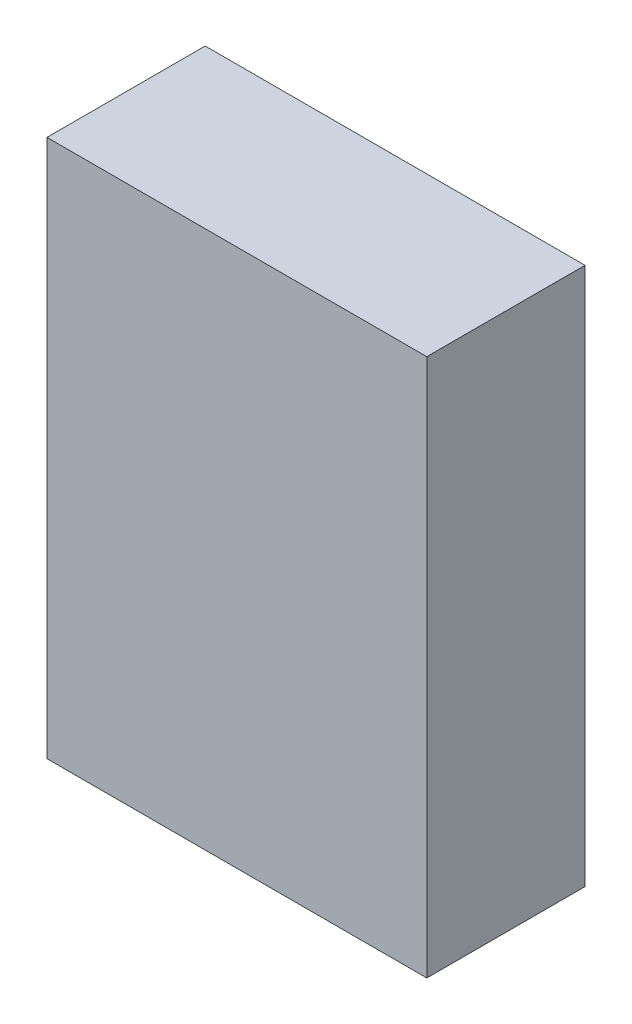
ISO-10303-21;
HEADER;
FILE_DESCRIPTION(('STEP AP214'),'2;1');
FILE_NAME('part.step','',(''),(''),'','','');
FILE_SCHEMA(('AUTOMOTIVE_DESIGN { 1 0 10303 214 1 1 1 1 }'));
ENDSEC;
DATA;
#1=APPLICATION_CONTEXT('core data for automotive mechanical design processes');
#2=APPLICATION_PROTOCOL_DEFINITION('international standard','automotive_design',2000,#1);
#3=PRODUCT_CONTEXT('',#1,'mechanical');
#4=PRODUCT('Part','Part','',(#3));
#5=PRODUCT_RELATED_PRODUCT_CATEGORY('part','',(#4));
#6=PRODUCT_DEFINITION_FORMATION('','',#4);
#7=PRODUCT_DEFINITION_CONTEXT('part definition',#1,'design');
#8=PRODUCT_DEFINITION('design','',#6,#7);
#9=PRODUCT_DEFINITION_SHAPE('','',#8);
#10=(LENGTH_UNIT() NAMED_UNIT(*) SI_UNIT(.MILLI.,.METRE.));
#11=(NAMED_UNIT(*) PLANE_ANGLE_UNIT() SI_UNIT($,.RADIAN.));
#12=(NAMED_UNIT(*) SI_UNIT($,.STERADIAN.) SOLID_ANGLE_UNIT());
#13=UNCERTAINTY_MEASURE_WITH_UNIT(LENGTH_MEASURE(1.E-05),#10,'distance_accuracy_value','');
#14=(GEOMETRIC_REPRESENTATION_CONTEXT(3) GLOBAL_UNCERTAINTY_ASSIGNED_CONTEXT((#13)) GLOBAL_UNIT_ASSIGNED_CONTEXT((#10,
#11,#12)) REPRESENTATION_CONTEXT('',''));
#15=CARTESIAN_POINT('',(0.,0.,0.));
#16=DIRECTION('',(0.,0.,1.));
#17=DIRECTION('',(1.,0.,0.));
#18=AXIS2_PLACEMENT_3D('',#15,#16,#17);
#19=CARTESIAN_POINT('',(1.63,-2.92,0.));
#20=DIRECTION('',(1.,0.,0.));
#21=DIRECTION('',(0.,0.,1.));
#22=AXIS2_PLACEMENT_3D('',#19,#20,#21);
#23=PLANE('',#22);
#24=DIRECTION('',(0.,1.,0.));
#25=VECTOR('',#24,1.);
#26=CARTESIAN_POINT('',(1.63,-2.92,0.1));
#27=LINE('',#26,#25);
#28=CARTESIAN_POINT('',(1.63,-2.92,0.1));
#29=VERTEX_POINT('',#28);
#30=CARTESIAN_POINT('',(1.63,-2.58,0.1));
#31=VERTEX_POINT('',#30);
#32=EDGE_CURVE('E11',#29,#31,#27,.T.);
#33=ORIENTED_EDGE('',*,*,#32,.T.);
#34=DIRECTION('',(0.,0.,1.));
#35=VECTOR('',#34,1.);
#36=CARTESIAN_POINT('',(1.63,-2.58,0.));
#37=LINE('',#36,#35);
#38=CARTESIAN_POINT('',(1.63,-2.58,0.));
#39=VERTEX_POINT('',#38);
#40=EDGE_CURVE('E24',#39,#31,#37,.T.);
#41=ORIENTED_EDGE('',*,*,#40,.F.);
#42=DIRECTION('',(0.,1.,0.));
#43=VECTOR('',#42,1.);
#44=CARTESIAN_POINT('',(1.63,-2.92,0.));
#45=LINE('',#44,#43);
#46=CARTESIAN_POINT('',(1.63,-2.92,0.));
#47=VERTEX_POINT('',#46);
#48=EDGE_CURVE('E86',#47,#39,#45,.T.);
#49=ORIENTED_EDGE('',*,*,#48,.F.);
#50=DIRECTION('',(0.,0.,1.));
#51=VECTOR('',#50,1.);
#52=CARTESIAN_POINT('',(1.63,-2.92,0.));
#53=LINE('',#52,#51);
#54=EDGE_CURVE('E36',#47,#29,#53,.T.);
#55=ORIENTED_EDGE('',*,*,#54,.T.);
#56=EDGE_LOOP('',(#33,#41,#49,#55));
#57=FACE_BOUND('',#56,.T.);
#58=ADVANCED_FACE('F17',(#57),#23,.F.);
#59=CARTESIAN_POINT('',(1.87,-2.92,0.));
#60=DIRECTION('',(1.,0.,0.));
#61=DIRECTION('',(0.,0.,1.));
#62=AXIS2_PLACEMENT_3D('',#59,#60,#61);
#63=PLANE('',#62);
#64=DIRECTION('',(0.,0.,1.));
#65=VECTOR('',#64,1.);
#66=CARTESIAN_POINT('',(1.87,-2.92,0.));
#67=LINE('',#66,#65);
#68=CARTESIAN_POINT('',(1.87,-2.92,0.));
#69=VERTEX_POINT('',#68);
#70=CARTESIAN_POINT('',(1.87,-2.92,0.1));
#71=VERTEX_POINT('',#70);
#72=EDGE_CURVE('E83',#69,#71,#67,.T.);
#73=ORIENTED_EDGE('',*,*,#72,.F.);
#74=DIRECTION('',(0.,1.,0.));
#75=VECTOR('',#74,1.);
#76=CARTESIAN_POINT('',(1.87,-2.92,0.));
#77=LINE('',#76,#75);
#78=CARTESIAN_POINT('',(1.87,-2.58,0.));
#79=VERTEX_POINT('',#78);
#80=EDGE_CURVE('E63',#69,#79,#77,.T.);
#81=ORIENTED_EDGE('',*,*,#80,.T.);
#82=DIRECTION('',(0.,0.,1.));
#83=VECTOR('',#82,1.);
#84=CARTESIAN_POINT('',(1.87,-2.58,0.));
#85=LINE('',#84,#83);
#86=CARTESIAN_POINT('',(1.87,-2.58,0.1));
#87=VERTEX_POINT('',#86);
#88=EDGE_CURVE('E57',#79,#87,#85,.T.);
#89=ORIENTED_EDGE('',*,*,#88,.T.);
#90=DIRECTION('',(0.,1.,0.));
#91=VECTOR('',#90,1.);
#92=CARTESIAN_POINT('',(1.87,-2.92,0.1));
#93=LINE('',#92,#91);
#94=EDGE_CURVE('E60',#71,#87,#93,.T.);
#95=ORIENTED_EDGE('',*,*,#94,.F.);
#96=EDGE_LOOP('',(#73,#81,#89,#95));
#97=FACE_BOUND('',#96,.T.);
#98=ADVANCED_FACE('F59',(#97),#63,.T.);
#99=CARTESIAN_POINT('',(1.63,-2.92,0.));
#100=DIRECTION('',(0.,1.,0.));
#101=DIRECTION('',(0.,0.,1.));
#102=AXIS2_PLACEMENT_3D('',#99,#100,#101);
#103=PLANE('',#102);
#104=ORIENTED_EDGE('',*,*,#72,.T.);
#105=DIRECTION('',(1.,0.,0.));
#106=VECTOR('',#105,1.);
#107=CARTESIAN_POINT('',(1.63,-2.92,0.1));
#108=LINE('',#107,#106);
#109=EDGE_CURVE('E71',#29,#71,#108,.T.);
#110=ORIENTED_EDGE('',*,*,#109,.F.);
#111=ORIENTED_EDGE('',*,*,#54,.F.);
#112=DIRECTION('',(1.,0.,0.));
#113=VECTOR('',#112,1.);
#114=CARTESIAN_POINT('',(1.63,-2.92,0.));
#115=LINE('',#114,#113);
#116=EDGE_CURVE('E76',#47,#69,#115,.T.);
#117=ORIENTED_EDGE('',*,*,#116,.T.);
#118=EDGE_LOOP('',(#104,#110,#111,#117));
#119=FACE_BOUND('',#118,.T.);
#120=ADVANCED_FACE('F91',(#119),#103,.F.);
#121=CARTESIAN_POINT('',(1.63,-2.58,0.));
#122=DIRECTION('',(0.,1.,0.));
#123=DIRECTION('',(0.,0.,1.));
#124=AXIS2_PLACEMENT_3D('',#121,#122,#123);
#125=PLANE('',#124);
#126=DIRECTION('',(1.,0.,0.));
#127=VECTOR('',#126,1.);
#128=CARTESIAN_POINT('',(1.63,-2.58,0.));
#129=LINE('',#128,#127);
#130=EDGE_CURVE('E74',#39,#79,#129,.T.);
#131=ORIENTED_EDGE('',*,*,#130,.F.);
#132=ORIENTED_EDGE('',*,*,#40,.T.);
#133=DIRECTION('',(1.,0.,0.));
#134=VECTOR('',#133,1.);
#135=CARTESIAN_POINT('',(1.63,-2.58,0.1));
#136=LINE('',#135,#134);
#137=EDGE_CURVE('E69',#31,#87,#136,.T.);
#138=ORIENTED_EDGE('',*,*,#137,.T.);
#139=ORIENTED_EDGE('',*,*,#88,.F.);
#140=EDGE_LOOP('',(#131,#132,#138,#139));
#141=FACE_BOUND('',#140,.T.);
#142=ADVANCED_FACE('F73',(#141),#125,.T.);
#143=CARTESIAN_POINT('',(1.63,-2.92,0.));
#144=DIRECTION('',(0.,0.,1.));
#145=DIRECTION('',(1.,0.,0.));
#146=AXIS2_PLACEMENT_3D('',#143,#144,#145);
#147=PLANE('',#146);
#148=ORIENTED_EDGE('',*,*,#130,.T.);
#149=ORIENTED_EDGE('',*,*,#80,.F.);
#150=ORIENTED_EDGE('',*,*,#116,.F.);
#151=ORIENTED_EDGE('',*,*,#48,.T.);
#152=EDGE_LOOP('',(#148,#149,#150,#151));
#153=FACE_BOUND('',#152,.T.);
#154=ADVANCED_FACE('F89',(#153),#147,.F.);
#155=CARTESIAN_POINT('',(1.63,-2.92,0.1));
#156=DIRECTION('',(0.,0.,1.));
#157=DIRECTION('',(1.,0.,0.));
#158=AXIS2_PLACEMENT_3D('',#155,#156,#157);
#159=PLANE('',#158);
#160=ORIENTED_EDGE('',*,*,#32,.F.);
#161=ORIENTED_EDGE('',*,*,#109,.T.);
#162=ORIENTED_EDGE('',*,*,#94,.T.);
#163=ORIENTED_EDGE('',*,*,#137,.F.);
#164=EDGE_LOOP('',(#160,#161,#162,#163));
#165=FACE_BOUND('',#164,.T.);
#166=ADVANCED_FACE('F68',(#165),#159,.T.);
#167=CLOSED_SHELL('',(#58,#98,#120,#142,#154,#166));
#168=MANIFOLD_SOLID_BREP('B1',#167);
#169=ADVANCED_BREP_SHAPE_REPRESENTATION('',(#18,#168),#14);
#170=SHAPE_DEFINITION_REPRESENTATION(#9,#169);
ENDSEC;
END-ISO-10303-21;
